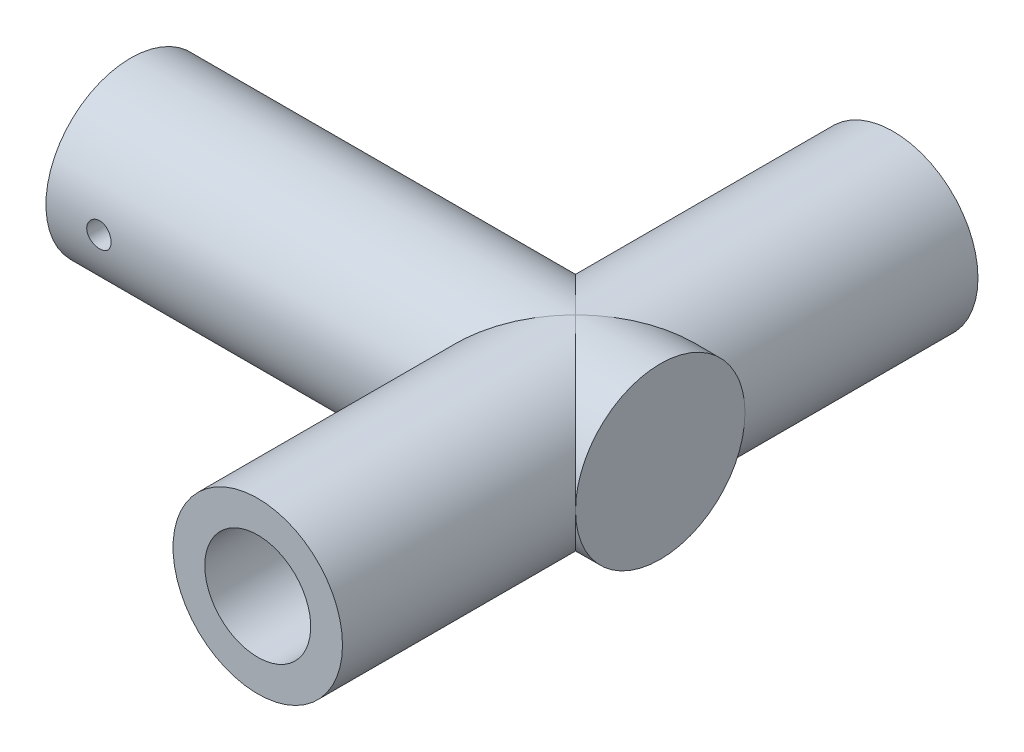
ISO-10303-21;
HEADER;
FILE_DESCRIPTION(('STEP AP214'),'2;1');
FILE_NAME('part.step','',(''),(''),'','','');
FILE_SCHEMA(('AUTOMOTIVE_DESIGN { 1 0 10303 214 1 1 1 1 }'));
ENDSEC;
DATA;
#1=APPLICATION_CONTEXT('core data for automotive mechanical design processes');
#2=APPLICATION_PROTOCOL_DEFINITION('international standard','automotive_design',2000,#1);
#3=PRODUCT_CONTEXT('',#1,'mechanical');
#4=PRODUCT('Part','Part','',(#3));
#5=PRODUCT_RELATED_PRODUCT_CATEGORY('part','',(#4));
#6=PRODUCT_DEFINITION_FORMATION('','',#4);
#7=PRODUCT_DEFINITION_CONTEXT('part definition',#1,'design');
#8=PRODUCT_DEFINITION('design','',#6,#7);
#9=PRODUCT_DEFINITION_SHAPE('','',#8);
#10=(LENGTH_UNIT() NAMED_UNIT(*) SI_UNIT(.MILLI.,.METRE.));
#11=(NAMED_UNIT(*) PLANE_ANGLE_UNIT() SI_UNIT($,.RADIAN.));
#12=(NAMED_UNIT(*) SI_UNIT($,.STERADIAN.) SOLID_ANGLE_UNIT());
#13=UNCERTAINTY_MEASURE_WITH_UNIT(LENGTH_MEASURE(1.E-05),#10,'distance_accuracy_value','');
#14=(GEOMETRIC_REPRESENTATION_CONTEXT(3) GLOBAL_UNCERTAINTY_ASSIGNED_CONTEXT((#13)) GLOBAL_UNIT_ASSIGNED_CONTEXT((#10,
#11,#12)) REPRESENTATION_CONTEXT('',''));
#15=CARTESIAN_POINT('',(0.,0.,0.));
#16=DIRECTION('',(0.,0.,1.));
#17=DIRECTION('',(1.,0.,0.));
#18=AXIS2_PLACEMENT_3D('',#15,#16,#17);
#19=CARTESIAN_POINT('',(50.,0.,0.));
#20=DIRECTION('',(-1.,0.,0.));
#21=DIRECTION('',(0.,0.,1.));
#22=AXIS2_PLACEMENT_3D('',#19,#20,#21);
#23=CYLINDRICAL_SURFACE('',#22,8.);
#24=CARTESIAN_POINT('',(42.,0.,0.));
#25=DIRECTION('',(-0.707106781186547,0.,-0.707106781186547));
#26=DIRECTION('',(-0.707106781186547,0.,0.707106781186547));
#27=AXIS2_PLACEMENT_3D('',#24,#25,#26);
#28=ELLIPSE('',#27,11.3137084989848,8.);
#29=CARTESIAN_POINT('',(50.,0.,-8.));
#30=VERTEX_POINT('',#29);
#31=CARTESIAN_POINT('',(42.,8.,0.));
#32=VERTEX_POINT('',#31);
#33=EDGE_CURVE('E58',#30,#32,#28,.F.);
#34=ORIENTED_EDGE('',*,*,#33,.T.);
#35=CARTESIAN_POINT('',(42.,0.,0.));
#36=DIRECTION('',(-0.707106781186547,0.,0.707106781186547));
#37=DIRECTION('',(-0.707106781186547,0.,-0.707106781186547));
#38=AXIS2_PLACEMENT_3D('',#35,#36,#37);
#39=ELLIPSE('',#38,11.3137084989848,8.);
#40=CARTESIAN_POINT('',(50.,0.,8.));
#41=VERTEX_POINT('',#40);
#42=EDGE_CURVE('E85',#32,#41,#39,.F.);
#43=ORIENTED_EDGE('',*,*,#42,.T.);
#44=CARTESIAN_POINT('',(50.,0.,0.));
#45=DIRECTION('',(1.,0.,0.));
#46=DIRECTION('',(0.,0.,-1.));
#47=AXIS2_PLACEMENT_3D('',#44,#45,#46);
#48=CIRCLE('',#47,8.);
#49=EDGE_CURVE('E11',#30,#41,#48,.T.);
#50=ORIENTED_EDGE('',*,*,#49,.F.);
#51=EDGE_LOOP('',(#34,#43,#50));
#52=FACE_BOUND('',#51,.T.);
#53=ADVANCED_FACE('F35',(#52),#23,.T.);
#54=EDGE_CURVE('E50',#41,#30,#48,.T.);
#55=ORIENTED_EDGE('',*,*,#54,.F.);
#56=CARTESIAN_POINT('',(42.,-8.,0.));
#57=VERTEX_POINT('',#56);
#58=EDGE_CURVE('E83',#41,#57,#39,.F.);
#59=ORIENTED_EDGE('',*,*,#58,.T.);
#60=EDGE_CURVE('E74',#57,#30,#28,.F.);
#61=ORIENTED_EDGE('',*,*,#60,.T.);
#62=EDGE_LOOP('',(#55,#59,#61));
#63=FACE_BOUND('',#62,.T.);
#64=ADVANCED_FACE('F82',(#63),#23,.T.);
#65=CARTESIAN_POINT('',(50.,0.,0.));
#66=DIRECTION('',(1.,0.,0.));
#67=DIRECTION('',(0.,0.,-1.));
#68=AXIS2_PLACEMENT_3D('',#65,#66,#67);
#69=PLANE('',#68);
#70=ORIENTED_EDGE('',*,*,#49,.T.);
#71=ORIENTED_EDGE('',*,*,#54,.T.);
#72=EDGE_LOOP('',(#70,#71));
#73=FACE_BOUND('',#72,.T.);
#74=ADVANCED_FACE('F87',(#73),#69,.T.);
#75=CARTESIAN_POINT('',(42.,0.,-30.));
#76=DIRECTION('',(0.,0.,1.));
#77=DIRECTION('',(1.,0.,0.));
#78=AXIS2_PLACEMENT_3D('',#75,#76,#77);
#79=PLANE('',#78);
#80=CARTESIAN_POINT('',(42.,0.,-30.));
#81=DIRECTION('',(0.,0.,-1.));
#82=DIRECTION('',(-1.,0.,0.));
#83=AXIS2_PLACEMENT_3D('',#80,#81,#82);
#84=CIRCLE('',#83,5.);
#85=CARTESIAN_POINT('',(37.,0.,-30.));
#86=VERTEX_POINT('',#85);
#87=EDGE_CURVE('E175',#86,#86,#84,.T.);
#88=ORIENTED_EDGE('',*,*,#87,.F.);
#89=EDGE_LOOP('',(#88));
#90=FACE_BOUND('',#89,.T.);
#91=CARTESIAN_POINT('',(42.,0.,-30.));
#92=DIRECTION('',(0.,0.,1.));
#93=DIRECTION('',(1.,0.,0.));
#94=AXIS2_PLACEMENT_3D('',#91,#92,#93);
#95=CIRCLE('',#94,8.);
#96=CARTESIAN_POINT('',(50.,0.,-30.));
#97=VERTEX_POINT('',#96);
#98=EDGE_CURVE('E168',#97,#97,#95,.T.);
#99=ORIENTED_EDGE('',*,*,#98,.F.);
#100=EDGE_LOOP('',(#99));
#101=FACE_BOUND('',#100,.T.);
#102=ADVANCED_FACE('F189',(#90,#101),#79,.F.);
#103=CARTESIAN_POINT('',(42.,0.,-30.));
#104=DIRECTION('',(0.,0.,1.));
#105=DIRECTION('',(1.,0.,0.));
#106=AXIS2_PLACEMENT_3D('',#103,#104,#105);
#107=CYLINDRICAL_SURFACE('',#106,8.);
#108=ORIENTED_EDGE('',*,*,#98,.T.);
#109=EDGE_LOOP('',(#108));
#110=FACE_BOUND('',#109,.T.);
#111=ORIENTED_EDGE('',*,*,#60,.F.);
#112=CARTESIAN_POINT('',(42.,0.,0.));
#113=DIRECTION('',(-0.707106781186547,0.,0.707106781186547));
#114=DIRECTION('',(-0.707106781186547,0.,-0.707106781186547));
#115=AXIS2_PLACEMENT_3D('',#112,#113,#114);
#116=ELLIPSE('',#115,11.3137084989848,8.);
#117=EDGE_CURVE('E77',#32,#57,#116,.T.);
#118=ORIENTED_EDGE('',*,*,#117,.F.);
#119=ORIENTED_EDGE('',*,*,#33,.F.);
#120=EDGE_LOOP('',(#111,#118,#119));
#121=FACE_BOUND('',#120,.T.);
#122=ADVANCED_FACE('F73',(#110,#121),#107,.T.);
#123=CARTESIAN_POINT('',(42.,0.,30.));
#124=DIRECTION('',(0.,0.,1.));
#125=DIRECTION('',(1.,0.,0.));
#126=AXIS2_PLACEMENT_3D('',#123,#124,#125);
#127=CIRCLE('',#126,8.);
#128=CARTESIAN_POINT('',(50.,0.,30.));
#129=VERTEX_POINT('',#128);
#130=EDGE_CURVE('E171',#129,#129,#127,.T.);
#131=ORIENTED_EDGE('',*,*,#130,.F.);
#132=EDGE_LOOP('',(#131));
#133=FACE_BOUND('',#132,.T.);
#134=ORIENTED_EDGE('',*,*,#42,.F.);
#135=CARTESIAN_POINT('',(42.,0.,0.));
#136=DIRECTION('',(-0.707106781186547,0.,-0.707106781186547));
#137=DIRECTION('',(-0.707106781186547,0.,0.707106781186547));
#138=AXIS2_PLACEMENT_3D('',#135,#136,#137);
#139=ELLIPSE('',#138,11.3137084989848,8.);
#140=EDGE_CURVE('E66',#57,#32,#139,.T.);
#141=ORIENTED_EDGE('',*,*,#140,.F.);
#142=ORIENTED_EDGE('',*,*,#58,.F.);
#143=EDGE_LOOP('',(#134,#141,#142));
#144=FACE_BOUND('',#143,.T.);
#145=ADVANCED_FACE('F152',(#133,#144),#107,.T.);
#146=CARTESIAN_POINT('',(42.,0.,30.));
#147=DIRECTION('',(0.,0.,1.));
#148=DIRECTION('',(1.,0.,0.));
#149=AXIS2_PLACEMENT_3D('',#146,#147,#148);
#150=PLANE('',#149);
#151=CARTESIAN_POINT('',(42.,0.,30.));
#152=DIRECTION('',(0.,0.,-1.));
#153=DIRECTION('',(-1.,0.,0.));
#154=AXIS2_PLACEMENT_3D('',#151,#152,#153);
#155=CIRCLE('',#154,5.);
#156=CARTESIAN_POINT('',(37.,0.,30.));
#157=VERTEX_POINT('',#156);
#158=EDGE_CURVE('E174',#157,#157,#155,.T.);
#159=ORIENTED_EDGE('',*,*,#158,.T.);
#160=EDGE_LOOP('',(#159));
#161=FACE_BOUND('',#160,.T.);
#162=ORIENTED_EDGE('',*,*,#130,.T.);
#163=EDGE_LOOP('',(#162));
#164=FACE_BOUND('',#163,.T.);
#165=ADVANCED_FACE('F147',(#161,#164),#150,.T.);
#166=CARTESIAN_POINT('',(0.,0.,0.));
#167=DIRECTION('',(1.,0.,0.));
#168=DIRECTION('',(0.,0.,-1.));
#169=AXIS2_PLACEMENT_3D('',#166,#167,#168);
#170=PLANE('',#169);
#171=CARTESIAN_POINT('',(0.,0.,0.));
#172=DIRECTION('',(-1.,0.,0.));
#173=DIRECTION('',(0.,0.,1.));
#174=AXIS2_PLACEMENT_3D('',#171,#172,#173);
#175=CIRCLE('',#174,4.);
#176=CARTESIAN_POINT('',(0.,0.,4.));
#177=VERTEX_POINT('',#176);
#178=EDGE_CURVE('E139',#177,#177,#175,.T.);
#179=ORIENTED_EDGE('',*,*,#178,.F.);
#180=EDGE_LOOP('',(#179));
#181=FACE_BOUND('',#180,.T.);
#182=CARTESIAN_POINT('',(0.,0.,0.));
#183=DIRECTION('',(1.,0.,0.));
#184=DIRECTION('',(0.,0.,-1.));
#185=AXIS2_PLACEMENT_3D('',#182,#183,#184);
#186=CIRCLE('',#185,8.);
#187=CARTESIAN_POINT('',(0.,0.,-8.));
#188=VERTEX_POINT('',#187);
#189=EDGE_CURVE('E88',#188,#188,#186,.T.);
#190=ORIENTED_EDGE('',*,*,#189,.F.);
#191=EDGE_LOOP('',(#190));
#192=FACE_BOUND('',#191,.T.);
#193=ADVANCED_FACE('F109',(#181,#192),#170,.F.);
#194=CARTESIAN_POINT('',(5.,0.,-8.));
#195=DIRECTION('',(0.,0.,1.));
#196=DIRECTION('',(1.,0.,0.));
#197=AXIS2_PLACEMENT_3D('',#194,#195,#196);
#198=CYLINDRICAL_SURFACE('',#197,1.15);
#199=CARTESIAN_POINT('',(6.15,0.,-4.));
#200=CARTESIAN_POINT('',(6.14999892565179,-0.0632073734755082,-3.99999927178093));
#201=CARTESIAN_POINT('',(6.14477154468687,-0.12642575910715,-3.99848732167176));
#202=CARTESIAN_POINT('',(6.12404483744725,-0.251029173639274,-3.99260320329084));
#203=CARTESIAN_POINT('',(6.10854172558166,-0.312413518163872,-3.98822998093082));
#204=CARTESIAN_POINT('',(6.06781839553861,-0.431533139474883,-3.97710387082426));
#205=CARTESIAN_POINT('',(6.04261182271302,-0.489273408567516,-3.97035432588058));
#206=CARTESIAN_POINT('',(5.98325099608363,-0.599707693111862,-3.95518162832269));
#207=CARTESIAN_POINT('',(5.94909577425015,-0.652401161777901,-3.94675829466841));
#208=CARTESIAN_POINT('',(5.8718494791121,-0.752647099692634,-3.92889031165977));
#209=CARTESIAN_POINT('',(5.82856411101421,-0.800046350571864,-3.9194260442181));
#210=CARTESIAN_POINT('',(5.7347007930962,-0.887022954417984,-3.90066328787024));
#211=CARTESIAN_POINT('',(5.68412173597633,-0.926599117547089,-3.89136482437705));
#212=CARTESIAN_POINT('',(5.57583896399627,-0.997589200337307,-3.87378166708879));
#213=CARTESIAN_POINT('',(5.51801103511749,-1.02882029476259,-3.86552150182319));
#214=CARTESIAN_POINT('',(5.39764851619916,-1.08105353727844,-3.85124157718571));
#215=CARTESIAN_POINT('',(5.33511495640498,-1.1020579169146,-3.84522132911484));
#216=CARTESIAN_POINT('',(5.20882802932876,-1.13269686956455,-3.83630658446016));
#217=CARTESIAN_POINT('',(5.14514834246294,-1.14261215158174,-3.8333350815159));
#218=CARTESIAN_POINT('',(5.01696537493064,-1.15166750519009,-3.83062478823401));
#219=CARTESIAN_POINT('',(4.95246227883558,-1.15080995062511,-3.83088528571013));
#220=CARTESIAN_POINT('',(4.82670980856109,-1.13856536983555,-3.83454105025505));
#221=CARTESIAN_POINT('',(4.76542316422683,-1.12752524674695,-3.83783303384903));
#222=CARTESIAN_POINT('',(4.64561130136999,-1.09578750666363,-3.84701442129088));
#223=CARTESIAN_POINT('',(4.58708633582999,-1.07508900680059,-3.85290406258689));
#224=CARTESIAN_POINT('',(4.47358914681713,-1.02435618103082,-3.86670278738029));
#225=CARTESIAN_POINT('',(4.41867192797757,-0.99420585101202,-3.87463673287519));
#226=CARTESIAN_POINT('',(4.31455791924498,-0.925505945288071,-3.89161761645962));
#227=CARTESIAN_POINT('',(4.26536242069513,-0.886954479138531,-3.90066480485401));
#228=CARTESIAN_POINT('',(4.17211495908318,-0.800803989085977,-3.91927597241624));
#229=CARTESIAN_POINT('',(4.12833111644566,-0.752915707621042,-3.92884649392213));
#230=CARTESIAN_POINT('',(4.04935612530939,-0.650357683826495,-3.94711844942546));
#231=CARTESIAN_POINT('',(4.01416543329778,-0.595687581464113,-3.95581983723809));
#232=CARTESIAN_POINT('',(3.95323056319498,-0.480658592558442,-3.97144192022445));
#233=CARTESIAN_POINT('',(3.9275415962304,-0.420268941684499,-3.97835214023762));
#234=CARTESIAN_POINT('',(3.88676165083313,-0.295782526809225,-3.98953781247287));
#235=CARTESIAN_POINT('',(3.87166796638708,-0.231686713883738,-3.99381393740323));
#236=CARTESIAN_POINT('',(3.85294352485431,-0.103890162481339,-3.99914501193534));
#237=CARTESIAN_POINT('',(3.84894896066527,-0.040246910293556,-4.00030215608087));
#238=CARTESIAN_POINT('',(3.85152226898866,0.0868026252726213,-3.99956237813116));
#239=CARTESIAN_POINT('',(3.8580888568086,0.150208936532892,-3.99766582749715));
#240=CARTESIAN_POINT('',(3.88130210113838,0.273640534588507,-3.99109835017445));
#241=CARTESIAN_POINT('',(3.897739920043,0.333708443156458,-3.98648493995155));
#242=CARTESIAN_POINT('',(3.93998116124906,0.450223874087314,-3.97501304241577));
#243=CARTESIAN_POINT('',(3.96578567239653,0.506670974645585,-3.9681542940991));
#244=CARTESIAN_POINT('',(4.02666306688244,0.615710320601646,-3.95272076906118));
#245=CARTESIAN_POINT('',(4.06192603785797,0.668191471096265,-3.94411179019361));
#246=CARTESIAN_POINT('',(4.14048539426676,0.766616997464251,-3.92616931411979));
#247=CARTESIAN_POINT('',(4.18378363020589,0.812559863268396,-3.91683565030858));
#248=CARTESIAN_POINT('',(4.27889035998512,0.898180626368672,-3.8981095979961));
#249=CARTESIAN_POINT('',(4.33093338343174,0.937600358975219,-3.88872551934356));
#250=CARTESIAN_POINT('',(4.44109838015472,1.00716029735685,-3.87129419651873));
#251=CARTESIAN_POINT('',(4.49922014730922,1.0373008176407,-3.8632469070417));
#252=CARTESIAN_POINT('',(4.61965774605499,1.08722829900497,-3.84949424022894));
#253=CARTESIAN_POINT('',(4.68194964301177,1.10706944048997,-3.84377664235632));
#254=CARTESIAN_POINT('',(4.80918246348449,1.13593155566543,-3.83534743215555));
#255=CARTESIAN_POINT('',(4.8741225653356,1.14495585950374,-3.83263489468782));
#256=CARTESIAN_POINT('',(5.00214205466531,1.1517147081829,-3.83060883206938));
#257=CARTESIAN_POINT('',(5.06519766141413,1.14986768397859,-3.83116932329085));
#258=CARTESIAN_POINT('',(5.19005810091002,1.13592419102417,-3.83532632485082));
#259=CARTESIAN_POINT('',(5.25186297630465,1.1238280723537,-3.83892273149116));
#260=CARTESIAN_POINT('',(5.37184480236453,1.08998967132238,-3.84866538937553));
#261=CARTESIAN_POINT('',(5.43005293614027,1.06834959936875,-3.85478457891753));
#262=CARTESIAN_POINT('',(5.54205835201993,1.01611667381349,-3.86888037742998));
#263=CARTESIAN_POINT('',(5.59585484317945,0.985522219292035,-3.87685731848857));
#264=CARTESIAN_POINT('',(5.69947339423604,0.915037981881834,-3.89410607899752));
#265=CARTESIAN_POINT('',(5.74909994367192,0.874869239560769,-3.90341252388899));
#266=CARTESIAN_POINT('',(5.84104379189504,0.786889738386917,-3.92209430298757));
#267=CARTESIAN_POINT('',(5.88335924027423,0.739077050762717,-3.93146965401039));
#268=CARTESIAN_POINT('',(5.96057434297708,0.635663527640367,-3.94952583922925));
#269=CARTESIAN_POINT('',(5.99525177756787,0.579892078971717,-3.95818217941179));
#270=CARTESIAN_POINT('',(6.05468652305411,0.463061883762637,-3.97354191086432));
#271=CARTESIAN_POINT('',(6.07944916070278,0.402005997803394,-3.98024635026885));
#272=CARTESIAN_POINT('',(6.11573397260774,0.284464722997896,-3.99025066669274));
#273=CARTESIAN_POINT('',(6.12855091463084,0.228403853227557,-3.99387787597118));
#274=CARTESIAN_POINT('',(6.14568383175305,0.114898227476695,-3.99875270987949));
#275=CARTESIAN_POINT('',(6.15000097655126,0.0574536630147288,-4.00000066192994));
#276=CARTESIAN_POINT('',(6.15,0.,-4.));
#277=B_SPLINE_CURVE_WITH_KNOTS('',3,(#199,#200,#201,#202,#203,#204,#205,#206,#207,#208,#209,
#210,#211,#212,#213,#214,#215,#216,#217,#218,#219,#220,#221,#222,#223,#224,#225,#226,#227,#228,
#229,#230,#231,#232,#233,#234,#235,#236,#237,#238,#239,#240,#241,#242,#243,#244,#245,#246,#247,
#248,#249,#250,#251,#252,#253,#254,#255,#256,#257,#258,#259,#260,#261,#262,#263,#264,#265,#266,
#267,#268,#269,#270,#271,#272,#273,#274,#275,#276),.UNSPECIFIED.,.T.,.F.,(4,2,2,2,2,2,2,2,2,2,2,
2,2,2,2,2,2,2,2,2,2,2,2,2,2,2,2,2,2,2,2,2,2,2,2,2,2,2,4),(0.,0.189411214621968,
0.378892247362748,0.568107792786364,0.757343815261271,0.951108739949324,1.14490311231151,
1.3426478263127,1.54034937157955,1.73292427490667,1.92545674421659,2.11166298348716,
2.29788624713035,2.48649098578826,2.67513820865432,2.87098856222164,3.06684931753015,
3.26383090710772,3.46076216967097,3.65115767170559,3.84153001517075,4.02801008974277,
4.2145118489334,4.40508622854378,4.59570455165024,4.79264173571029,4.98957224406445,
5.18545601409019,5.38127946245633,5.56961634419095,5.75794679313799,5.94430753237795,
6.13070161071635,6.32338883776624,6.51612476190689,6.71388792547786,6.91154469719258,
7.08373767698167,7.25590695878734),.UNSPECIFIED.);
#278=CARTESIAN_POINT('',(6.15,0.,-4.));
#279=VERTEX_POINT('',#278);
#280=EDGE_CURVE('E84',#279,#279,#277,.T.);
#281=ORIENTED_EDGE('',*,*,#280,.F.);
#282=EDGE_LOOP('',(#281));
#283=FACE_BOUND('',#282,.T.);
#284=CARTESIAN_POINT('',(6.15,0.,-8.));
#285=CARTESIAN_POINT('',(6.14999732771938,0.0642408049877371,-7.99999900104572));
#286=CARTESIAN_POINT('',(6.1445989448832,0.128519652980568,-7.99921808360381));
#287=CARTESIAN_POINT('',(6.12315229578025,0.255282799618418,-7.99617799460856));
#288=CARTESIAN_POINT('',(6.1070934594711,0.317765252888202,-7.99391735591458));
#289=CARTESIAN_POINT('',(6.06481385212908,0.439082574572753,-7.98817203710949));
#290=CARTESIAN_POINT('',(6.03860053906147,0.49792008331913,-7.98468825551234));
#291=CARTESIAN_POINT('',(5.97677381613512,0.610351637975352,-7.97688227468734));
#292=CARTESIAN_POINT('',(5.94116179304888,0.66394645584252,-7.97256019917403));
#293=CARTESIAN_POINT('',(5.86127516684978,0.764766661764776,-7.96352398065286));
#294=CARTESIAN_POINT('',(5.81694629524749,0.811948843689611,-7.95880749368689));
#295=CARTESIAN_POINT('',(5.7210010447174,0.898231842531928,-7.94953252105251));
#296=CARTESIAN_POINT('',(5.66938426023176,0.937332209413952,-7.94497404419463));
#297=CARTESIAN_POINT('',(5.56004049505801,1.00650802371406,-7.93650841852456));
#298=CARTESIAN_POINT('',(5.50228702590844,1.03654200439407,-7.93260429763607));
#299=CARTESIAN_POINT('',(5.38249003046271,1.0864675482395,-7.92592118377974));
#300=CARTESIAN_POINT('',(5.32044671896836,1.10635961881553,-7.92314213452478));
#301=CARTESIAN_POINT('',(5.19428419024598,1.13530322192503,-7.91904671954876));
#302=CARTESIAN_POINT('',(5.1301822152705,1.1444284795832,-7.91772041081279));
#303=CARTESIAN_POINT('',(5.00134414331279,1.15180774890946,-7.91665040690486));
#304=CARTESIAN_POINT('',(4.93660807999413,1.15006233460847,-7.91690662816666));
#305=CARTESIAN_POINT('',(4.80885837273092,1.13581012618109,-7.91896363910354));
#306=CARTESIAN_POINT('',(4.7458353787835,1.12338520139894,-7.92075267783692));
#307=CARTESIAN_POINT('',(4.62277814928006,1.08825471573794,-7.92565539729002));
#308=CARTESIAN_POINT('',(4.56274399198014,1.06554888583321,-7.92876911267313));
#309=CARTESIAN_POINT('',(4.44711809625796,1.01041522050277,-7.93598342277185));
#310=CARTESIAN_POINT('',(4.39154323650672,0.977952468577041,-7.9400875512442));
#311=CARTESIAN_POINT('',(4.28659868683666,0.904251352809147,-7.94881765890928));
#312=CARTESIAN_POINT('',(4.23722937166717,0.863012459385364,-7.95344366958621));
#313=CARTESIAN_POINT('',(4.1456226469014,0.772479132292403,-7.9627483164706));
#314=CARTESIAN_POINT('',(4.10345482751469,0.723114261432543,-7.9674270461007));
#315=CARTESIAN_POINT('',(4.02799216042946,0.617970986095613,-7.97627046609689));
#316=CARTESIAN_POINT('',(3.99469734607163,0.562192557520456,-7.98043515453142));
#317=CARTESIAN_POINT('',(3.93792317360833,0.445746967011738,-7.98778509418622));
#318=CARTESIAN_POINT('',(3.91444891459362,0.385077284860599,-7.99096983636619));
#319=CARTESIAN_POINT('',(3.8780412929454,0.260601053217965,-7.99599671406996));
#320=CARTESIAN_POINT('',(3.86510727635351,0.196794698598544,-7.99783893288849));
#321=CARTESIAN_POINT('',(3.85023919965213,0.0684572526869461,-7.99996222018021));
#322=CARTESIAN_POINT('',(3.84820941683089,0.00393746732978532,-8.00025687342971));
#323=CARTESIAN_POINT('',(3.85495373830221,-0.124521496425833,-7.999288729241));
#324=CARTESIAN_POINT('',(3.86372753617077,-0.188460691239874,-7.99802597597581));
#325=CARTESIAN_POINT('',(3.89175038097979,-0.313655526667759,-7.99409331311151));
#326=CARTESIAN_POINT('',(3.9109530567122,-0.374921759209016,-7.99142963426516));
#327=CARTESIAN_POINT('',(3.95923984765889,-0.493364907422298,-7.98499293981722));
#328=CARTESIAN_POINT('',(3.98832439374399,-0.550541644651905,-7.98121987584501));
#329=CARTESIAN_POINT('',(4.05577576116081,-0.659605445882387,-7.97295024382637));
#330=CARTESIAN_POINT('',(4.09420362380035,-0.711454396374389,-7.96844898589569));
#331=CARTESIAN_POINT('',(4.1791654513161,-0.808001311857939,-7.95923930691842));
#332=CARTESIAN_POINT('',(4.22569984695198,-0.852698896602608,-7.95453087487308));
#333=CARTESIAN_POINT('',(4.32597877695057,-0.934020282454374,-7.94539474577163));
#334=CARTESIAN_POINT('',(4.37977544951477,-0.970580102070607,-7.94096945583034));
#335=CARTESIAN_POINT('',(4.49280243066093,-1.03414415920532,-7.93294249556064));
#336=CARTESIAN_POINT('',(4.55203260199682,-1.06114863800084,-7.92934080443677));
#337=CARTESIAN_POINT('',(4.67405030617708,-1.10473510377908,-7.92338601462806));
#338=CARTESIAN_POINT('',(4.73682537453818,-1.12135139885136,-7.92102880994844));
#339=CARTESIAN_POINT('',(4.86431134050902,-1.14379938641425,-7.91781874690666));
#340=CARTESIAN_POINT('',(4.92902211598198,-1.14963175788264,-7.9169657938339));
#341=CARTESIAN_POINT('',(5.05790522431433,-1.15033116689778,-7.9168641456544));
#342=CARTESIAN_POINT('',(5.12207702258147,-1.14529877707239,-7.91760073647182));
#343=CARTESIAN_POINT('',(5.24865183278398,-1.12462635733195,-7.92056329512527));
#344=CARTESIAN_POINT('',(5.31105484666139,-1.10898633906408,-7.92278926132596));
#345=CARTESIAN_POINT('',(5.43229669441715,-1.0675771191345,-7.92847477397618));
#346=CARTESIAN_POINT('',(5.49113777182344,-1.04181437164256,-7.93193353427598));
#347=CARTESIAN_POINT('',(5.60367853863676,-0.980900943565068,-7.93969595860109));
#348=CARTESIAN_POINT('',(5.65737808271472,-0.945749997721824,-7.94399964649841));
#349=CARTESIAN_POINT('',(5.75862333566672,-0.866690429748946,-7.95301453042627));
#350=CARTESIAN_POINT('',(5.80611047877347,-0.822707171611601,-7.95772899109036));
#351=CARTESIAN_POINT('',(5.8930662985873,-0.727389044529358,-7.9670065394763));
#352=CARTESIAN_POINT('',(5.93253310280114,-0.676052463576699,-7.97156959164151));
#353=CARTESIAN_POINT('',(6.00250366236326,-0.567182363544949,-7.98005625699983));
#354=CARTESIAN_POINT('',(6.03296128149669,-0.509618940242657,-7.98397653444585));
#355=CARTESIAN_POINT('',(6.08373128520973,-0.390165807318724,-7.99070303791919));
#356=CARTESIAN_POINT('',(6.10405431585173,-0.328280715736713,-7.99351043235601));
#357=CARTESIAN_POINT('',(6.12929937688012,-0.221755131390279,-7.99704436125728));
#358=CARTESIAN_POINT('',(6.13705043873509,-0.177776258150422,-7.9981471123671));
#359=CARTESIAN_POINT('',(6.14740164995842,-0.0892043674858569,-7.9996252746124));
#360=CARTESIAN_POINT('',(6.1500018557374,-0.0446113567923817,-8.00000069371338));
#361=CARTESIAN_POINT('',(6.15,0.,-8.));
#362=B_SPLINE_CURVE_WITH_KNOTS('',3,(#284,#285,#286,#287,#288,#289,#290,#291,#292,#293,#294,
#295,#296,#297,#298,#299,#300,#301,#302,#303,#304,#305,#306,#307,#308,#309,#310,#311,#312,#313,
#314,#315,#316,#317,#318,#319,#320,#321,#322,#323,#324,#325,#326,#327,#328,#329,#330,#331,#332,
#333,#334,#335,#336,#337,#338,#339,#340,#341,#342,#343,#344,#345,#346,#347,#348,#349,#350,#351,
#352,#353,#354,#355,#356,#357,#358,#359,#360,#361),.UNSPECIFIED.,.T.,.F.,(4,2,2,2,2,2,2,2,2,2,2,
2,2,2,2,2,2,2,2,2,2,2,2,2,2,2,2,2,2,2,2,2,2,2,2,2,2,2,4),(0.,0.192559417660434,
0.385310047387348,0.577919378812557,0.770500306750685,0.964320480125589,1.15815144346103,
1.35285594462526,1.54755070355888,1.74090441846407,1.9342479233222,2.12612233938317,
2.31800177661349,2.51057622668565,2.70316230063836,2.89751532872536,3.09186908709181,
3.28632363417289,3.48076611560505,3.67349886227998,3.86622614256551,4.05810340923306,
4.2499890432367,4.4431636702465,4.63634856517684,4.83100252608836,5.02565157154124,
5.21965432380739,5.41364486084932,5.60584737597924,5.79804968007129,5.9901296358774,
6.18221501935695,6.375997612307,6.56982539546426,6.76462924090846,6.95922801776628,
7.09295036086187,7.22667123946267),.UNSPECIFIED.);
#363=CARTESIAN_POINT('',(6.15,0.,-8.));
#364=VERTEX_POINT('',#363);
#365=EDGE_CURVE('E100',#364,#364,#362,.T.);
#366=ORIENTED_EDGE('',*,*,#365,.F.);
#367=EDGE_LOOP('',(#366));
#368=FACE_BOUND('',#367,.T.);
#369=ADVANCED_FACE('F106',(#283,#368),#198,.F.);
#370=ORIENTED_EDGE('',*,*,#365,.T.);
#371=EDGE_LOOP('',(#370));
#372=FACE_BOUND('',#371,.T.);
#373=CARTESIAN_POINT('',(6.15,0.,8.));
#374=CARTESIAN_POINT('',(6.14999732771938,-0.0642408049877371,7.99999900104572));
#375=CARTESIAN_POINT('',(6.1445989448832,-0.128519652980568,7.99921808360381));
#376=CARTESIAN_POINT('',(6.12315229578025,-0.255282799618418,7.99617799460856));
#377=CARTESIAN_POINT('',(6.1070934594711,-0.317765252888202,7.99391735591458));
#378=CARTESIAN_POINT('',(6.06481385212908,-0.439082574572753,7.98817203710949));
#379=CARTESIAN_POINT('',(6.03860053906147,-0.49792008331913,7.98468825551234));
#380=CARTESIAN_POINT('',(5.97677381613512,-0.610351637975352,7.97688227468734));
#381=CARTESIAN_POINT('',(5.94116179304888,-0.66394645584252,7.97256019917403));
#382=CARTESIAN_POINT('',(5.86127516684978,-0.764766661764776,7.96352398065286));
#383=CARTESIAN_POINT('',(5.81694629524749,-0.811948843689611,7.95880749368689));
#384=CARTESIAN_POINT('',(5.7210010447174,-0.898231842531928,7.94953252105251));
#385=CARTESIAN_POINT('',(5.66938426023176,-0.937332209413952,7.94497404419463));
#386=CARTESIAN_POINT('',(5.56004049505801,-1.00650802371406,7.93650841852456));
#387=CARTESIAN_POINT('',(5.50228702590844,-1.03654200439407,7.93260429763607));
#388=CARTESIAN_POINT('',(5.38249003046271,-1.0864675482395,7.92592118377974));
#389=CARTESIAN_POINT('',(5.32044671896836,-1.10635961881553,7.92314213452478));
#390=CARTESIAN_POINT('',(5.19428419024598,-1.13530322192503,7.91904671954876));
#391=CARTESIAN_POINT('',(5.1301822152705,-1.1444284795832,7.91772041081279));
#392=CARTESIAN_POINT('',(5.00134414331279,-1.15180774890946,7.91665040690486));
#393=CARTESIAN_POINT('',(4.93660807999413,-1.15006233460847,7.91690662816666));
#394=CARTESIAN_POINT('',(4.80885837273092,-1.13581012618109,7.91896363910354));
#395=CARTESIAN_POINT('',(4.7458353787835,-1.12338520139894,7.92075267783692));
#396=CARTESIAN_POINT('',(4.62277814928006,-1.08825471573794,7.92565539729002));
#397=CARTESIAN_POINT('',(4.56274399198014,-1.06554888583321,7.92876911267313));
#398=CARTESIAN_POINT('',(4.44711809625796,-1.01041522050277,7.93598342277185));
#399=CARTESIAN_POINT('',(4.39154323650672,-0.977952468577041,7.9400875512442));
#400=CARTESIAN_POINT('',(4.28659868683666,-0.904251352809147,7.94881765890928));
#401=CARTESIAN_POINT('',(4.23722937166717,-0.863012459385364,7.95344366958621));
#402=CARTESIAN_POINT('',(4.1456226469014,-0.772479132292403,7.9627483164706));
#403=CARTESIAN_POINT('',(4.10345482751469,-0.723114261432543,7.9674270461007));
#404=CARTESIAN_POINT('',(4.02799216042946,-0.617970986095613,7.97627046609689));
#405=CARTESIAN_POINT('',(3.99469734607163,-0.562192557520456,7.98043515453142));
#406=CARTESIAN_POINT('',(3.93792317360833,-0.445746967011738,7.98778509418622));
#407=CARTESIAN_POINT('',(3.91444891459362,-0.385077284860599,7.99096983636619));
#408=CARTESIAN_POINT('',(3.8780412929454,-0.260601053217965,7.99599671406996));
#409=CARTESIAN_POINT('',(3.86510727635351,-0.196794698598544,7.99783893288849));
#410=CARTESIAN_POINT('',(3.85023919965213,-0.0684572526869461,7.99996222018021));
#411=CARTESIAN_POINT('',(3.84820941683089,-0.00393746732978532,8.00025687342971));
#412=CARTESIAN_POINT('',(3.85495373830221,0.124521496425833,7.999288729241));
#413=CARTESIAN_POINT('',(3.86372753617077,0.188460691239874,7.99802597597581));
#414=CARTESIAN_POINT('',(3.89175038097979,0.313655526667759,7.99409331311151));
#415=CARTESIAN_POINT('',(3.9109530567122,0.374921759209016,7.99142963426516));
#416=CARTESIAN_POINT('',(3.95923984765889,0.493364907422298,7.98499293981722));
#417=CARTESIAN_POINT('',(3.98832439374399,0.550541644651905,7.98121987584501));
#418=CARTESIAN_POINT('',(4.05577576116081,0.659605445882387,7.97295024382637));
#419=CARTESIAN_POINT('',(4.09420362380035,0.711454396374389,7.96844898589569));
#420=CARTESIAN_POINT('',(4.1791654513161,0.808001311857939,7.95923930691842));
#421=CARTESIAN_POINT('',(4.22569984695198,0.852698896602608,7.95453087487308));
#422=CARTESIAN_POINT('',(4.32597877695057,0.934020282454374,7.94539474577163));
#423=CARTESIAN_POINT('',(4.37977544951477,0.970580102070607,7.94096945583034));
#424=CARTESIAN_POINT('',(4.49280243066093,1.03414415920532,7.93294249556064));
#425=CARTESIAN_POINT('',(4.55203260199682,1.06114863800084,7.92934080443677));
#426=CARTESIAN_POINT('',(4.67405030617708,1.10473510377908,7.92338601462806));
#427=CARTESIAN_POINT('',(4.73682537453818,1.12135139885136,7.92102880994844));
#428=CARTESIAN_POINT('',(4.86431134050902,1.14379938641425,7.91781874690666));
#429=CARTESIAN_POINT('',(4.92902211598198,1.14963175788264,7.9169657938339));
#430=CARTESIAN_POINT('',(5.05790522431433,1.15033116689778,7.9168641456544));
#431=CARTESIAN_POINT('',(5.12207702258147,1.14529877707239,7.91760073647182));
#432=CARTESIAN_POINT('',(5.24865183278398,1.12462635733195,7.92056329512527));
#433=CARTESIAN_POINT('',(5.31105484666139,1.10898633906408,7.92278926132596));
#434=CARTESIAN_POINT('',(5.43229669441715,1.0675771191345,7.92847477397618));
#435=CARTESIAN_POINT('',(5.49113777182344,1.04181437164256,7.93193353427598));
#436=CARTESIAN_POINT('',(5.60367853863676,0.980900943565068,7.93969595860109));
#437=CARTESIAN_POINT('',(5.65737808271472,0.945749997721824,7.94399964649841));
#438=CARTESIAN_POINT('',(5.75862333566672,0.866690429748946,7.95301453042627));
#439=CARTESIAN_POINT('',(5.80611047877347,0.822707171611601,7.95772899109036));
#440=CARTESIAN_POINT('',(5.8930662985873,0.727389044529358,7.9670065394763));
#441=CARTESIAN_POINT('',(5.93253310280114,0.676052463576699,7.97156959164151));
#442=CARTESIAN_POINT('',(6.00250366236326,0.567182363544949,7.98005625699983));
#443=CARTESIAN_POINT('',(6.03296128149669,0.509618940242657,7.98397653444585));
#444=CARTESIAN_POINT('',(6.08373128520973,0.390165807318724,7.99070303791919));
#445=CARTESIAN_POINT('',(6.10405431585173,0.328280715736713,7.99351043235601));
#446=CARTESIAN_POINT('',(6.12929937688012,0.221755131390279,7.99704436125728));
#447=CARTESIAN_POINT('',(6.13705043873509,0.177776258150422,7.9981471123671));
#448=CARTESIAN_POINT('',(6.14740164995842,0.0892043674858569,7.9996252746124));
#449=CARTESIAN_POINT('',(6.1500018557374,0.0446113567923817,8.00000069371338));
#450=CARTESIAN_POINT('',(6.15,0.,8.));
#451=B_SPLINE_CURVE_WITH_KNOTS('',3,(#373,#374,#375,#376,#377,#378,#379,#380,#381,#382,#383,
#384,#385,#386,#387,#388,#389,#390,#391,#392,#393,#394,#395,#396,#397,#398,#399,#400,#401,#402,
#403,#404,#405,#406,#407,#408,#409,#410,#411,#412,#413,#414,#415,#416,#417,#418,#419,#420,#421,
#422,#423,#424,#425,#426,#427,#428,#429,#430,#431,#432,#433,#434,#435,#436,#437,#438,#439,#440,
#441,#442,#443,#444,#445,#446,#447,#448,#449,#450),.UNSPECIFIED.,.T.,.F.,(4,2,2,2,2,2,2,2,2,2,2,
2,2,2,2,2,2,2,2,2,2,2,2,2,2,2,2,2,2,2,2,2,2,2,2,2,2,2,4),(0.,0.192559417660434,
0.385310047387348,0.577919378812557,0.770500306750685,0.964320480125589,1.15815144346103,
1.35285594462526,1.54755070355888,1.74090441846407,1.9342479233222,2.12612233938317,
2.31800177661349,2.51057622668565,2.70316230063836,2.89751532872536,3.09186908709181,
3.28632363417289,3.48076611560505,3.67349886227998,3.86622614256551,4.05810340923306,
4.2499890432367,4.4431636702465,4.63634856517684,4.83100252608836,5.02565157154124,
5.21965432380739,5.41364486084932,5.60584737597924,5.79804968007129,5.9901296358774,
6.18221501935695,6.375997612307,6.56982539546426,6.76462924090846,6.95922801776628,
7.09295036086187,7.22667123946267),.UNSPECIFIED.);
#452=CARTESIAN_POINT('',(6.15,0.,8.));
#453=VERTEX_POINT('',#452);
#454=EDGE_CURVE('E93',#453,#453,#451,.T.);
#455=ORIENTED_EDGE('',*,*,#454,.T.);
#456=EDGE_LOOP('',(#455));
#457=FACE_BOUND('',#456,.T.);
#458=ORIENTED_EDGE('',*,*,#140,.T.);
#459=ORIENTED_EDGE('',*,*,#117,.T.);
#460=EDGE_LOOP('',(#458,#459));
#461=FACE_BOUND('',#460,.T.);
#462=ORIENTED_EDGE('',*,*,#189,.T.);
#463=EDGE_LOOP('',(#462));
#464=FACE_BOUND('',#463,.T.);
#465=ADVANCED_FACE('F37',(#372,#457,#461,#464),#23,.T.);
#466=CARTESIAN_POINT('',(6.15,0.,4.));
#467=CARTESIAN_POINT('',(6.14999892565178,0.0632073734755084,3.99999927178093));
#468=CARTESIAN_POINT('',(6.14477154468687,0.12642575910715,3.99848732167176));
#469=CARTESIAN_POINT('',(6.12404483744725,0.251029173639274,3.99260320329084));
#470=CARTESIAN_POINT('',(6.10854172558166,0.312413518163872,3.98822998093082));
#471=CARTESIAN_POINT('',(6.06781839553861,0.431533139474883,3.97710387082426));
#472=CARTESIAN_POINT('',(6.04261182271302,0.489273408567516,3.97035432588058));
#473=CARTESIAN_POINT('',(5.98325099608363,0.599707693111862,3.95518162832269));
#474=CARTESIAN_POINT('',(5.94909577425015,0.652401161777901,3.94675829466841));
#475=CARTESIAN_POINT('',(5.8718494791121,0.752647099692634,3.92889031165977));
#476=CARTESIAN_POINT('',(5.82856411101421,0.800046350571864,3.9194260442181));
#477=CARTESIAN_POINT('',(5.7347007930962,0.887022954417984,3.90066328787024));
#478=CARTESIAN_POINT('',(5.68412173597633,0.926599117547089,3.89136482437705));
#479=CARTESIAN_POINT('',(5.57583896399627,0.997589200337307,3.87378166708879));
#480=CARTESIAN_POINT('',(5.51801103511749,1.02882029476259,3.86552150182319));
#481=CARTESIAN_POINT('',(5.39764851619916,1.08105353727844,3.85124157718571));
#482=CARTESIAN_POINT('',(5.33511495640498,1.1020579169146,3.84522132911484));
#483=CARTESIAN_POINT('',(5.20882802932876,1.13269686956455,3.83630658446016));
#484=CARTESIAN_POINT('',(5.14514834246294,1.14261215158174,3.8333350815159));
#485=CARTESIAN_POINT('',(5.01696537493064,1.15166750519009,3.83062478823401));
#486=CARTESIAN_POINT('',(4.95246227883558,1.15080995062511,3.83088528571013));
#487=CARTESIAN_POINT('',(4.82670980856109,1.13856536983555,3.83454105025505));
#488=CARTESIAN_POINT('',(4.76542316422683,1.12752524674695,3.83783303384903));
#489=CARTESIAN_POINT('',(4.64561130136999,1.09578750666363,3.84701442129088));
#490=CARTESIAN_POINT('',(4.58708633582999,1.07508900680059,3.85290406258689));
#491=CARTESIAN_POINT('',(4.47358914681713,1.02435618103082,3.86670278738029));
#492=CARTESIAN_POINT('',(4.41867192797757,0.99420585101202,3.87463673287519));
#493=CARTESIAN_POINT('',(4.31455791924498,0.925505945288071,3.89161761645962));
#494=CARTESIAN_POINT('',(4.26536242069513,0.886954479138531,3.90066480485401));
#495=CARTESIAN_POINT('',(4.17211495908318,0.800803989085977,3.91927597241624));
#496=CARTESIAN_POINT('',(4.12833111644566,0.752915707621042,3.92884649392213));
#497=CARTESIAN_POINT('',(4.04935612530939,0.650357683826495,3.94711844942546));
#498=CARTESIAN_POINT('',(4.01416543329778,0.595687581464113,3.95581983723809));
#499=CARTESIAN_POINT('',(3.95323056319498,0.480658592558442,3.97144192022445));
#500=CARTESIAN_POINT('',(3.9275415962304,0.420268941684499,3.97835214023762));
#501=CARTESIAN_POINT('',(3.88676165083313,0.295782526809225,3.98953781247287));
#502=CARTESIAN_POINT('',(3.87166796638708,0.231686713883738,3.99381393740323));
#503=CARTESIAN_POINT('',(3.85294352485431,0.103890162481339,3.99914501193534));
#504=CARTESIAN_POINT('',(3.84894896066527,0.040246910293556,4.00030215608087));
#505=CARTESIAN_POINT('',(3.85152226898866,-0.0868026252726213,3.99956237813116));
#506=CARTESIAN_POINT('',(3.8580888568086,-0.150208936532892,3.99766582749715));
#507=CARTESIAN_POINT('',(3.88130210113838,-0.273640534588507,3.99109835017445));
#508=CARTESIAN_POINT('',(3.897739920043,-0.333708443156458,3.98648493995155));
#509=CARTESIAN_POINT('',(3.93998116124906,-0.450223874087314,3.97501304241577));
#510=CARTESIAN_POINT('',(3.96578567239653,-0.506670974645585,3.9681542940991));
#511=CARTESIAN_POINT('',(4.02666306688244,-0.615710320601646,3.95272076906118));
#512=CARTESIAN_POINT('',(4.06192603785797,-0.668191471096265,3.94411179019361));
#513=CARTESIAN_POINT('',(4.14048539426676,-0.766616997464251,3.92616931411979));
#514=CARTESIAN_POINT('',(4.18378363020589,-0.812559863268396,3.91683565030858));
#515=CARTESIAN_POINT('',(4.27889035998512,-0.898180626368672,3.8981095979961));
#516=CARTESIAN_POINT('',(4.33093338343174,-0.937600358975219,3.88872551934356));
#517=CARTESIAN_POINT('',(4.44109838015472,-1.00716029735685,3.87129419651873));
#518=CARTESIAN_POINT('',(4.49922014730922,-1.0373008176407,3.8632469070417));
#519=CARTESIAN_POINT('',(4.61965774605499,-1.08722829900497,3.84949424022894));
#520=CARTESIAN_POINT('',(4.68194964301177,-1.10706944048997,3.84377664235632));
#521=CARTESIAN_POINT('',(4.80918246348449,-1.13593155566543,3.83534743215555));
#522=CARTESIAN_POINT('',(4.8741225653356,-1.14495585950374,3.83263489468782));
#523=CARTESIAN_POINT('',(5.00214205466531,-1.1517147081829,3.83060883206938));
#524=CARTESIAN_POINT('',(5.06519766141413,-1.14986768397859,3.83116932329085));
#525=CARTESIAN_POINT('',(5.19005810091002,-1.13592419102417,3.83532632485082));
#526=CARTESIAN_POINT('',(5.25186297630465,-1.1238280723537,3.83892273149116));
#527=CARTESIAN_POINT('',(5.37184480236453,-1.08998967132238,3.84866538937553));
#528=CARTESIAN_POINT('',(5.43005293614027,-1.06834959936875,3.85478457891753));
#529=CARTESIAN_POINT('',(5.54205835201993,-1.01611667381349,3.86888037742998));
#530=CARTESIAN_POINT('',(5.59585484317945,-0.985522219292035,3.87685731848857));
#531=CARTESIAN_POINT('',(5.69947339423604,-0.915037981881834,3.89410607899752));
#532=CARTESIAN_POINT('',(5.74909994367192,-0.874869239560769,3.90341252388899));
#533=CARTESIAN_POINT('',(5.84104379189504,-0.786889738386917,3.92209430298757));
#534=CARTESIAN_POINT('',(5.88335924027423,-0.739077050762717,3.93146965401039));
#535=CARTESIAN_POINT('',(5.96057434297708,-0.635663527640367,3.94952583922925));
#536=CARTESIAN_POINT('',(5.99525177756787,-0.579892078971717,3.95818217941179));
#537=CARTESIAN_POINT('',(6.05468652305411,-0.463061883762637,3.97354191086432));
#538=CARTESIAN_POINT('',(6.07944916070278,-0.402005997803394,3.98024635026885));
#539=CARTESIAN_POINT('',(6.11573397260774,-0.284464722997896,3.99025066669274));
#540=CARTESIAN_POINT('',(6.12855091463084,-0.228403853227557,3.99387787597118));
#541=CARTESIAN_POINT('',(6.14568383175305,-0.114898227476695,3.99875270987949));
#542=CARTESIAN_POINT('',(6.15000097655126,-0.0574536630147288,4.00000066192994));
#543=CARTESIAN_POINT('',(6.15,0.,4.));
#544=B_SPLINE_CURVE_WITH_KNOTS('',3,(#466,#467,#468,#469,#470,#471,#472,#473,#474,#475,#476,
#477,#478,#479,#480,#481,#482,#483,#484,#485,#486,#487,#488,#489,#490,#491,#492,#493,#494,#495,
#496,#497,#498,#499,#500,#501,#502,#503,#504,#505,#506,#507,#508,#509,#510,#511,#512,#513,#514,
#515,#516,#517,#518,#519,#520,#521,#522,#523,#524,#525,#526,#527,#528,#529,#530,#531,#532,#533,
#534,#535,#536,#537,#538,#539,#540,#541,#542,#543),.UNSPECIFIED.,.T.,.F.,(4,2,2,2,2,2,2,2,2,2,2,
2,2,2,2,2,2,2,2,2,2,2,2,2,2,2,2,2,2,2,2,2,2,2,2,2,2,2,4),(0.,0.189411214621968,
0.378892247362748,0.568107792786363,0.757343815261271,0.951108739949325,1.14490311231151,
1.3426478263127,1.54034937157955,1.73292427490667,1.92545674421659,2.11166298348716,
2.29788624713035,2.48649098578826,2.67513820865432,2.87098856222164,3.06684931753015,
3.26383090710772,3.46076216967097,3.65115767170559,3.84153001517075,4.02801008974277,
4.2145118489334,4.40508622854378,4.59570455165024,4.79264173571029,4.98957224406445,
5.18545601409019,5.38127946245633,5.56961634419095,5.757946793138,5.94430753237795,
6.13070161071635,6.32338883776624,6.51612476190689,6.71388792547787,6.91154469719258,
7.08373767698167,7.25590695878734),.UNSPECIFIED.);
#545=CARTESIAN_POINT('',(6.15,0.,4.));
#546=VERTEX_POINT('',#545);
#547=EDGE_CURVE('E101',#546,#546,#544,.T.);
#548=ORIENTED_EDGE('',*,*,#547,.F.);
#549=EDGE_LOOP('',(#548));
#550=FACE_BOUND('',#549,.T.);
#551=ORIENTED_EDGE('',*,*,#454,.F.);
#552=EDGE_LOOP('',(#551));
#553=FACE_BOUND('',#552,.T.);
#554=ADVANCED_FACE('F111',(#550,#553),#198,.F.);
#555=CARTESIAN_POINT('',(40.,0.,0.));
#556=DIRECTION('',(-1.,0.,0.));
#557=DIRECTION('',(0.,0.,1.));
#558=AXIS2_PLACEMENT_3D('',#555,#556,#557);
#559=CYLINDRICAL_SURFACE('',#558,4.);
#560=CARTESIAN_POINT('',(34.,0.,4.));
#561=CARTESIAN_POINT('',(34.0000003556781,-0.105191216468488,3.99999959515221));
#562=CARTESIAN_POINT('',(34.0020797237935,-0.210389995368427,3.99584554268467));
#563=CARTESIAN_POINT('',(34.0103440284902,-0.420011249701335,3.97927792190077));
#564=CARTESIAN_POINT('',(34.0165307511226,-0.524433367425618,3.96686076043045));
#565=CARTESIAN_POINT('',(34.032864023404,-0.731828138370604,3.93388648530473));
#566=CARTESIAN_POINT('',(34.043016219825,-0.834798506711917,3.9133177633431));
#567=CARTESIAN_POINT('',(34.0670161775637,-1.0384152051955,3.86428279244357));
#568=CARTESIAN_POINT('',(34.0808654495684,-1.1390605669938,3.83581331493588));
#569=CARTESIAN_POINT('',(34.1273402570786,-1.43561775388138,3.73925176888222));
#570=CARTESIAN_POINT('',(34.1649802352833,-1.6271962065847,3.65983701915264));
#571=CARTESIAN_POINT('',(34.2501711368116,-1.99392146995421,3.47371095891235));
#572=CARTESIAN_POINT('',(34.2977212786447,-2.16906957469774,3.36700180061893));
#573=CARTESIAN_POINT('',(34.4017494321411,-2.51002321260362,3.12193017740055));
#574=CARTESIAN_POINT('',(34.4585935273774,-2.67462250306452,2.98204331180567));
#575=CARTESIAN_POINT('',(34.5735996965199,-2.97911611963431,2.67792486241434));
#576=CARTESIAN_POINT('',(34.6317627370353,-3.11899161990724,2.51367490095672));
#577=CARTESIAN_POINT('',(34.748048648652,-3.38102385527715,2.15002101287013));
#578=CARTESIAN_POINT('',(34.8058186117609,-3.50096528772937,1.94887869572524));
#579=CARTESIAN_POINT('',(34.8829006970902,-3.65378721735264,1.63206546004573));
#580=CARTESIAN_POINT('',(34.9070057716279,-3.70022392693972,1.5239053371934));
#581=CARTESIAN_POINT('',(34.951123097882,-3.78359067078057,1.30319902892111));
#582=CARTESIAN_POINT('',(34.9711377714132,-3.82052633371565,1.19065548607789));
#583=CARTESIAN_POINT('',(35.0051955001357,-3.88251046204454,0.968805780693758));
#584=CARTESIAN_POINT('',(35.0195223553198,-3.9081340887804,0.859703580835429));
#585=CARTESIAN_POINT('',(35.0432293421141,-3.95018060072941,0.639259477179835));
#586=CARTESIAN_POINT('',(35.0526120981104,-3.96660836750271,0.527918794247388));
#587=CARTESIAN_POINT('',(35.0660306650994,-3.99001913809428,0.303993906533891));
#588=CARTESIAN_POINT('',(35.0700696962323,-3.99700782997252,0.191410491911587));
#589=CARTESIAN_POINT('',(35.0726297758454,-4.00144340059851,-0.0340004780387331));
#590=CARTESIAN_POINT('',(35.0711513507892,-3.99889118971828,-0.146828009047004));
#591=CARTESIAN_POINT('',(35.0632496144489,-3.98516575152016,-0.358164378446319));
#592=CARTESIAN_POINT('',(35.0574406895929,-3.97506329407581,-0.456767439572172));
#593=CARTESIAN_POINT('',(35.0418107470543,-3.94763759493625,-0.65265161216631));
#594=CARTESIAN_POINT('',(35.0319884692782,-3.93031208534669,-0.749932298520495));
#595=CARTESIAN_POINT('',(34.9969516479624,-3.86777248849784,-1.03877913290022));
#596=CARTESIAN_POINT('',(34.966160962594,-3.81198555026409,-1.22749545708121));
#597=CARTESIAN_POINT('',(34.8925008249302,-3.6728359957252,-1.59694633277079));
#598=CARTESIAN_POINT('',(34.8493667285624,-3.58886132884632,-1.77739257534817));
#599=CARTESIAN_POINT('',(34.7558634734618,-3.39616568981264,-2.12253018701489));
#600=CARTESIAN_POINT('',(34.7054910686776,-3.28743360222608,-2.28721443206492));
#601=CARTESIAN_POINT('',(34.5954754192652,-3.03227252755196,-2.61808288170461));
#602=CARTESIAN_POINT('',(34.5354665211112,-2.88281182497071,-2.7818095707084));
#603=CARTESIAN_POINT('',(34.4180881341003,-2.55818830727484,-3.08295960650049));
#604=CARTESIAN_POINT('',(34.3607199165569,-2.38301327894514,-3.22037038247453));
#605=CARTESIAN_POINT('',(34.2797239231383,-2.09944472683198,-3.40675303021424));
#606=CARTESIAN_POINT('',(34.2530369513781,-1.9989679987013,-3.46668175975306));
#607=CARTESIAN_POINT('',(34.2026955846773,-1.79256850112002,-3.57776647877665));
#608=CARTESIAN_POINT('',(34.1790399124253,-1.68664805204876,-3.62892616639792));
#609=CARTESIAN_POINT('',(34.1354595704047,-1.47010242051538,-3.7219191223728));
#610=CARTESIAN_POINT('',(34.1155333992177,-1.35947915341347,-3.76375614513254));
#611=CARTESIAN_POINT('',(34.0800077879628,-1.13432950721217,-3.8376199385518));
#612=CARTESIAN_POINT('',(34.0644078501776,-1.01980357880328,-3.86964783775915));
#613=CARTESIAN_POINT('',(34.0391232241438,-0.797438403015337,-3.92122684785512));
#614=CARTESIAN_POINT('',(34.0290556396266,-0.689830906854571,-3.94159159705698));
#615=CARTESIAN_POINT('',(34.0132557038416,-0.472998720376384,-3.9734464482425));
#616=CARTESIAN_POINT('',(34.0075229693439,-0.363774173887726,-3.98493733473706));
#617=CARTESIAN_POINT('',(34.000556994517,-0.144648447401174,-3.99889047154451));
#618=CARTESIAN_POINT('',(33.9993220316031,-0.0347475425961467,-4.00135617837902));
#619=CARTESIAN_POINT('',(34.0013819537925,0.184837638972485,-3.99723575788991));
#620=CARTESIAN_POINT('',(34.0046766384234,0.294521925108019,-3.99065003116341));
#621=CARTESIAN_POINT('',(34.0152726505968,0.504259611746536,-3.96937643047284));
#622=CARTESIAN_POINT('',(34.0222422374291,0.604398259266982,-3.95535893089557));
#623=CARTESIAN_POINT('',(34.0397801643488,0.803035609307666,-3.91986360033609));
#624=CARTESIAN_POINT('',(34.0503497263649,0.901533743070585,-3.89838323620656));
#625=CARTESIAN_POINT('',(34.0871087209428,1.19351737727532,-3.82306482640006));
#626=CARTESIAN_POINT('',(34.1183586686487,1.38368108667204,-3.75832985940934));
#627=CARTESIAN_POINT('',(34.1926310522532,1.75558493783057,-3.60000189109436));
#628=CARTESIAN_POINT('',(34.2359645445989,1.93692876519228,-3.50563669082804));
#629=CARTESIAN_POINT('',(34.3302412119979,2.28183826656572,-3.29156896574025));
#630=CARTESIAN_POINT('',(34.3811876260016,2.44539632212196,-3.17185564736844));
#631=CARTESIAN_POINT('',(34.4916691163299,2.76706877708067,-2.89696688029653));
#632=CARTESIAN_POINT('',(34.5515563093838,2.92307134240145,-2.73946346274087));
#633=CARTESIAN_POINT('',(34.6695126414375,3.20744226426287,-2.4002644347453));
#634=CARTESIAN_POINT('',(34.7275804991894,3.33579150415337,-2.2185522283969));
#635=CARTESIAN_POINT('',(34.8097183591256,3.50772930633183,-1.92600598557791));
#636=CARTESIAN_POINT('',(34.8368331594535,3.5626157867948,-1.82251624156373));
#637=CARTESIAN_POINT('',(34.8878218735588,3.66334616154282,-1.6104815646835));
#638=CARTESIAN_POINT('',(34.9116973477858,3.70919441458265,-1.50193909990485));
#639=CARTESIAN_POINT('',(34.9552773789625,3.79131200961918,-1.28057835463572));
#640=CARTESIAN_POINT('',(34.9749852814546,3.82758904080802,-1.16776359020464));
#641=CARTESIAN_POINT('',(35.0094174618001,3.89012004539429,-0.938647210928471));
#642=CARTESIAN_POINT('',(35.0241425112503,3.91637557070638,-0.82234613897846));
#643=CARTESIAN_POINT('',(35.0467897438001,3.95643062416587,-0.59858786683691));
#644=CARTESIAN_POINT('',(35.0552292020794,3.97118378192521,-0.491353167091614));
#645=CARTESIAN_POINT('',(35.0671455853029,3.99195118317071,-0.275772329799359));
#646=CARTESIAN_POINT('',(35.0706230301834,3.99796634225491,-0.167426309898701));
#647=CARTESIAN_POINT('',(35.072467919362,4.00116308319383,0.049407496730375));
#648=CARTESIAN_POINT('',(35.0708371598193,3.99834777004019,0.157895220223278));
#649=CARTESIAN_POINT('',(35.0625490651802,3.98394653809981,0.374061147113534));
#650=CARTESIAN_POINT('',(35.0558919358612,3.97236097836303,0.481739383468672));
#651=CARTESIAN_POINT('',(35.0304712041714,3.92770249100378,0.781800137041294));
#652=CARTESIAN_POINT('',(35.0062723985761,3.88483285002042,0.972365867313808));
#653=CARTESIAN_POINT('',(34.9451631758416,3.77270184038046,1.34326850255324));
#654=CARTESIAN_POINT('',(34.9082486700643,3.70343198216887,1.5236020957039));
#655=CARTESIAN_POINT('',(34.8228577472062,3.53526338936953,1.88248855351399));
#656=CARTESIAN_POINT('',(34.77377116616,3.43468670285354,2.06010777576172));
#657=CARTESIAN_POINT('',(34.6705866725764,3.20860173383709,2.39710197827702));
#658=CARTESIAN_POINT('',(34.6164861606989,3.08308048046465,2.55646739854074));
#659=CARTESIAN_POINT('',(34.5015085175916,2.7928225080539,2.87256290903849));
#660=CARTESIAN_POINT('',(34.4406067162654,2.625174026051,3.02661992962373));
#661=CARTESIAN_POINT('',(34.3248838607046,2.26458287075638,3.30506842281289));
#662=CARTESIAN_POINT('',(34.270066092556,2.0716266499056,3.42944390524207));
#663=CARTESIAN_POINT('',(34.1966478948264,1.76603106757847,3.59090424941519));
#664=CARTESIAN_POINT('',(34.1735663207093,1.66100410373828,3.64069364140905));
#665=CARTESIAN_POINT('',(34.1310820375722,1.44639623629744,3.73114894700146));
#666=CARTESIAN_POINT('',(34.1116775219626,1.33681760142932,3.77181934269804));
#667=CARTESIAN_POINT('',(34.0771641273431,1.11415600876093,3.84347634443401));
#668=CARTESIAN_POINT('',(34.0620458859057,1.00108129646084,3.87448407138671));
#669=CARTESIAN_POINT('',(34.0365230541638,0.772189766950845,3.92651008001648));
#670=CARTESIAN_POINT('',(34.0261155846955,0.656374670304619,3.94753446377235));
#671=CARTESIAN_POINT('',(34.0121888995621,0.450433316283308,3.97557962119869));
#672=CARTESIAN_POINT('',(34.0076260757862,0.360660623567814,3.98472938917604));
#673=CARTESIAN_POINT('',(34.0015314315121,0.180593821057087,3.99693983637807));
#674=CARTESIAN_POINT('',(33.9999996946739,0.0902996969389662,4.00000034753503));
#675=CARTESIAN_POINT('',(34.,0.,4.));
#676=B_SPLINE_CURVE_WITH_KNOTS('',3,(#560,#561,#562,#563,#564,#565,#566,#567,#568,#569,#570,
#571,#572,#573,#574,#575,#576,#577,#578,#579,#580,#581,#582,#583,#584,#585,#586,#587,#588,#589,
#590,#591,#592,#593,#594,#595,#596,#597,#598,#599,#600,#601,#602,#603,#604,#605,#606,#607,#608,
#609,#610,#611,#612,#613,#614,#615,#616,#617,#618,#619,#620,#621,#622,#623,#624,#625,#626,#627,
#628,#629,#630,#631,#632,#633,#634,#635,#636,#637,#638,#639,#640,#641,#642,#643,#644,#645,#646,
#647,#648,#649,#650,#651,#652,#653,#654,#655,#656,#657,#658,#659,#660,#661,#662,#663,#664,#665,
#666,#667,#668,#669,#670,#671,#672,#673,#674,#675),.UNSPECIFIED.,.T.,.F.,(4,2,2,2,2,2,2,2,2,2,2,
2,2,2,2,2,2,2,2,2,2,2,2,2,2,2,2,2,2,2,2,2,2,2,2,2,2,2,2,2,2,2,2,2,2,2,2,2,2,2,2,2,2,2,2,2,2,4),
(0.,0.315484235719912,0.631105747230253,0.947178346952276,1.26338029745354,1.89263632058595,
2.52184274094302,3.18911473348911,3.85689264923289,4.57645675584686,4.93648208726456,
5.29629363598333,5.63476191634051,5.97305035229576,6.31113484191766,6.64918707308226,
6.94669148652859,7.24428938086225,7.83905304157541,8.44767049128776,9.05656173495714,
9.74265853790341,10.4290822684957,10.7886699173095,11.1481055433964,11.5073961555811,
11.8666454155399,12.1961419049363,12.5256092612256,12.8549504227676,13.184277008843,
13.4879760335491,13.791778244799,14.3988188497914,15.02321622567,15.6478800144877,
16.33388641032,17.0203655291613,17.380682030865,17.7408243397693,18.1006764355618,
18.4604727825931,18.7857371805983,19.1109674938045,19.4360834615763,19.7611861199664,
20.3488209353335,20.9366448769133,21.5639619965908,22.1916061711245,22.8955134356508,
23.5997990605887,23.9548906509477,24.3098073249809,24.6639426811876,25.0178613011449,
25.2886761616556,25.5594984967416),.UNSPECIFIED.);
#677=CARTESIAN_POINT('',(34.,0.,4.));
#678=VERTEX_POINT('',#677);
#679=EDGE_CURVE('E40',#678,#678,#676,.T.);
#680=ORIENTED_EDGE('',*,*,#679,.T.);
#681=EDGE_LOOP('',(#680));
#682=FACE_BOUND('',#681,.T.);
#683=ORIENTED_EDGE('',*,*,#547,.T.);
#684=EDGE_LOOP('',(#683));
#685=FACE_BOUND('',#684,.T.);
#686=ORIENTED_EDGE('',*,*,#280,.T.);
#687=EDGE_LOOP('',(#686));
#688=FACE_BOUND('',#687,.T.);
#689=ORIENTED_EDGE('',*,*,#178,.T.);
#690=EDGE_LOOP('',(#689));
#691=FACE_BOUND('',#690,.T.);
#692=ADVANCED_FACE('F114',(#682,#685,#688,#691),#559,.F.);
#693=ORIENTED_EDGE('',*,*,#679,.F.);
#694=EDGE_LOOP('',(#693));
#695=FACE_BOUND('',#694,.T.);
#696=ADVANCED_FACE('F185',(#695),#107,.T.);
#697=CARTESIAN_POINT('',(42.,0.,30.));
#698=DIRECTION('',(0.,0.,-1.));
#699=DIRECTION('',(-1.,0.,0.));
#700=AXIS2_PLACEMENT_3D('',#697,#698,#699);
#701=CYLINDRICAL_SURFACE('',#700,5.);
#702=ORIENTED_EDGE('',*,*,#158,.F.);
#703=EDGE_LOOP('',(#702));
#704=FACE_BOUND('',#703,.T.);
#705=ORIENTED_EDGE('',*,*,#87,.T.);
#706=EDGE_LOOP('',(#705));
#707=FACE_BOUND('',#706,.T.);
#708=ADVANCED_FACE('F182',(#704,#707),#701,.F.);
#709=CLOSED_SHELL('',(#53,#64,#74,#102,#122,#145,#165,#193,#369,#465,#554,#692,#696,#708));
#710=MANIFOLD_SOLID_BREP('B2',#709);
#711=ADVANCED_BREP_SHAPE_REPRESENTATION('',(#18,#710),#14);
#712=SHAPE_DEFINITION_REPRESENTATION(#9,#711);
ENDSEC;
END-ISO-10303-21;
